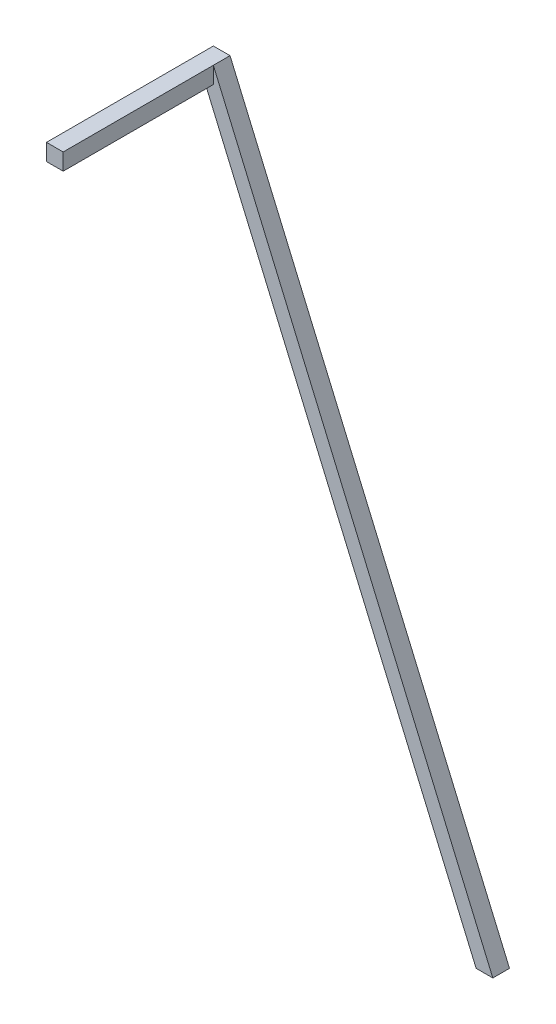
ISO-10303-21;
HEADER;
FILE_DESCRIPTION(('STEP AP214'),'2;1');
FILE_NAME('part.step','',(''),(''),'','','');
FILE_SCHEMA(('AUTOMOTIVE_DESIGN { 1 0 10303 214 1 1 1 1 }'));
ENDSEC;
DATA;
#1=APPLICATION_CONTEXT('core data for automotive mechanical design processes');
#2=APPLICATION_PROTOCOL_DEFINITION('international standard','automotive_design',2000,#1);
#3=PRODUCT_CONTEXT('',#1,'mechanical');
#4=PRODUCT('Part','Part','',(#3));
#5=PRODUCT_RELATED_PRODUCT_CATEGORY('part','',(#4));
#6=PRODUCT_DEFINITION_FORMATION('','',#4);
#7=PRODUCT_DEFINITION_CONTEXT('part definition',#1,'design');
#8=PRODUCT_DEFINITION('design','',#6,#7);
#9=PRODUCT_DEFINITION_SHAPE('','',#8);
#10=(LENGTH_UNIT() NAMED_UNIT(*) SI_UNIT(.MILLI.,.METRE.));
#11=(NAMED_UNIT(*) PLANE_ANGLE_UNIT() SI_UNIT($,.RADIAN.));
#12=(NAMED_UNIT(*) SI_UNIT($,.STERADIAN.) SOLID_ANGLE_UNIT());
#13=UNCERTAINTY_MEASURE_WITH_UNIT(LENGTH_MEASURE(1.E-05),#10,'distance_accuracy_value','');
#14=(GEOMETRIC_REPRESENTATION_CONTEXT(3) GLOBAL_UNCERTAINTY_ASSIGNED_CONTEXT((#13)) GLOBAL_UNIT_ASSIGNED_CONTEXT((#10,
#11,#12)) REPRESENTATION_CONTEXT('',''));
#15=CARTESIAN_POINT('',(0.,0.,0.));
#16=DIRECTION('',(0.,0.,1.));
#17=DIRECTION('',(1.,0.,0.));
#18=AXIS2_PLACEMENT_3D('',#15,#16,#17);
#19=CARTESIAN_POINT('',(12.7,12.7,25.4));
#20=DIRECTION('',(1.,0.,0.));
#21=DIRECTION('',(0.,0.,-1.));
#22=AXIS2_PLACEMENT_3D('',#19,#20,#21);
#23=PLANE('',#22);
#24=DIRECTION('',(0.,-1.,0.));
#25=VECTOR('',#24,1.);
#26=CARTESIAN_POINT('',(12.7,12.7,0.));
#27=LINE('',#26,#25);
#28=CARTESIAN_POINT('',(12.7,12.7,0.));
#29=VERTEX_POINT('',#28);
#30=CARTESIAN_POINT('',(12.7,-12.7,0.));
#31=VERTEX_POINT('',#30);
#32=EDGE_CURVE('E119',#29,#31,#27,.T.);
#33=ORIENTED_EDGE('',*,*,#32,.T.);
#34=DIRECTION('',(0.,0.,-1.));
#35=VECTOR('',#34,1.);
#36=CARTESIAN_POINT('',(12.7,-12.7,25.4));
#37=LINE('',#36,#35);
#38=CARTESIAN_POINT('',(12.7,-12.7,25.4));
#39=VERTEX_POINT('',#38);
#40=EDGE_CURVE('E12',#39,#31,#37,.T.);
#41=ORIENTED_EDGE('',*,*,#40,.F.);
#42=DIRECTION('',(0.,-1.,0.));
#43=VECTOR('',#42,1.);
#44=CARTESIAN_POINT('',(12.7,12.7,25.4));
#45=LINE('',#44,#43);
#46=CARTESIAN_POINT('',(12.7,12.7,25.4));
#47=VERTEX_POINT('',#46);
#48=EDGE_CURVE('E127',#47,#39,#45,.T.);
#49=ORIENTED_EDGE('',*,*,#48,.F.);
#50=DIRECTION('',(0.,0.,-1.));
#51=VECTOR('',#50,1.);
#52=CARTESIAN_POINT('',(12.7,12.7,25.4));
#53=LINE('',#52,#51);
#54=EDGE_CURVE('E115',#47,#29,#53,.T.);
#55=ORIENTED_EDGE('',*,*,#54,.T.);
#56=EDGE_LOOP('',(#33,#41,#49,#55));
#57=FACE_BOUND('',#56,.T.);
#58=ADVANCED_FACE('F45',(#57),#23,.F.);
#59=CARTESIAN_POINT('',(-1.79102564102583,-12.7,25.4));
#60=DIRECTION('',(0.,-1.,0.));
#61=DIRECTION('',(0.,0.,-1.));
#62=AXIS2_PLACEMENT_3D('',#59,#60,#61);
#63=PLANE('',#62);
#64=DIRECTION('',(-1.,0.,0.));
#65=VECTOR('',#64,1.);
#66=CARTESIAN_POINT('',(-1.79102564102583,-12.7,0.));
#67=LINE('',#66,#65);
#68=CARTESIAN_POINT('',(-1.79102564102583,-12.7,0.));
#69=VERTEX_POINT('',#68);
#70=EDGE_CURVE('E122',#31,#69,#67,.T.);
#71=ORIENTED_EDGE('',*,*,#70,.T.);
#72=DIRECTION('',(0.,0.,-1.));
#73=VECTOR('',#72,1.);
#74=CARTESIAN_POINT('',(-1.79102564102583,-12.7,25.4));
#75=LINE('',#74,#73);
#76=CARTESIAN_POINT('',(-1.79102564102583,-12.7,25.4));
#77=VERTEX_POINT('',#76);
#78=EDGE_CURVE('E53',#77,#69,#75,.T.);
#79=ORIENTED_EDGE('',*,*,#78,.F.);
#80=DIRECTION('',(-1.,0.,0.));
#81=VECTOR('',#80,1.);
#82=CARTESIAN_POINT('',(-1.79102564102583,-12.7,25.4));
#83=LINE('',#82,#81);
#84=EDGE_CURVE('E95',#39,#77,#83,.T.);
#85=ORIENTED_EDGE('',*,*,#84,.F.);
#86=ORIENTED_EDGE('',*,*,#40,.T.);
#87=EDGE_LOOP('',(#71,#79,#85,#86));
#88=FACE_BOUND('',#87,.T.);
#89=ADVANCED_FACE('F146',(#88),#63,.F.);
#90=CARTESIAN_POINT('',(412.75,-977.9,25.4));
#91=DIRECTION('',(0.918840099923866,0.39463004291602,0.));
#92=DIRECTION('',(-0.39463004291602,0.918840099923866,0.));
#93=AXIS2_PLACEMENT_3D('',#90,#91,#92);
#94=PLANE('',#93);
#95=DIRECTION('',(0.39463004291602,-0.918840099923866,0.));
#96=VECTOR('',#95,1.);
#97=CARTESIAN_POINT('',(412.75,-977.9,0.));
#98=LINE('',#97,#96);
#99=CARTESIAN_POINT('',(412.75,-977.9,0.));
#100=VERTEX_POINT('',#99);
#101=EDGE_CURVE('E110',#69,#100,#98,.T.);
#102=ORIENTED_EDGE('',*,*,#101,.T.);
#103=DIRECTION('',(0.,0.,-1.));
#104=VECTOR('',#103,1.);
#105=CARTESIAN_POINT('',(412.75,-977.9,25.4));
#106=LINE('',#105,#104);
#107=CARTESIAN_POINT('',(412.75,-977.9,25.4));
#108=VERTEX_POINT('',#107);
#109=EDGE_CURVE('E107',#108,#100,#106,.T.);
#110=ORIENTED_EDGE('',*,*,#109,.F.);
#111=DIRECTION('',(0.39463004291602,-0.918840099923866,0.));
#112=VECTOR('',#111,1.);
#113=CARTESIAN_POINT('',(412.75,-977.9,25.4));
#114=LINE('',#113,#112);
#115=EDGE_CURVE('E99',#77,#108,#114,.T.);
#116=ORIENTED_EDGE('',*,*,#115,.F.);
#117=ORIENTED_EDGE('',*,*,#78,.T.);
#118=EDGE_LOOP('',(#102,#110,#116,#117));
#119=FACE_BOUND('',#118,.T.);
#120=ADVANCED_FACE('F108',(#119),#94,.F.);
#121=CARTESIAN_POINT('',(412.75,-977.9,25.4));
#122=DIRECTION('',(0.,1.,0.));
#123=DIRECTION('',(0.,0.,1.));
#124=AXIS2_PLACEMENT_3D('',#121,#122,#123);
#125=PLANE('',#124);
#126=DIRECTION('',(1.,0.,0.));
#127=VECTOR('',#126,1.);
#128=CARTESIAN_POINT('',(412.75,-977.9,0.));
#129=LINE('',#128,#127);
#130=CARTESIAN_POINT('',(438.15,-977.9,0.));
#131=VERTEX_POINT('',#130);
#132=EDGE_CURVE('E81',#100,#131,#129,.T.);
#133=ORIENTED_EDGE('',*,*,#132,.T.);
#134=DIRECTION('',(0.,0.,-1.));
#135=VECTOR('',#134,1.);
#136=CARTESIAN_POINT('',(438.15,-977.9,25.4));
#137=LINE('',#136,#135);
#138=CARTESIAN_POINT('',(438.15,-977.9,25.4));
#139=VERTEX_POINT('',#138);
#140=EDGE_CURVE('E111',#139,#131,#137,.T.);
#141=ORIENTED_EDGE('',*,*,#140,.F.);
#142=DIRECTION('',(1.,0.,0.));
#143=VECTOR('',#142,1.);
#144=CARTESIAN_POINT('',(412.75,-977.9,25.4));
#145=LINE('',#144,#143);
#146=EDGE_CURVE('E103',#108,#139,#145,.T.);
#147=ORIENTED_EDGE('',*,*,#146,.F.);
#148=ORIENTED_EDGE('',*,*,#109,.T.);
#149=EDGE_LOOP('',(#133,#141,#147,#148));
#150=FACE_BOUND('',#149,.T.);
#151=ADVANCED_FACE('F113',(#150),#125,.F.);
#152=CARTESIAN_POINT('',(12.7,12.7,25.4));
#153=DIRECTION('',(-0.918840099923866,-0.394630042916019,0.));
#154=DIRECTION('',(0.394630042916019,-0.918840099923866,0.));
#155=AXIS2_PLACEMENT_3D('',#152,#153,#154);
#156=PLANE('',#155);
#157=DIRECTION('',(-0.39463004291602,0.918840099923866,0.));
#158=VECTOR('',#157,1.);
#159=CARTESIAN_POINT('',(12.7,12.7,0.));
#160=LINE('',#159,#158);
#161=EDGE_CURVE('E87',#131,#29,#160,.T.);
#162=ORIENTED_EDGE('',*,*,#161,.T.);
#163=ORIENTED_EDGE('',*,*,#54,.F.);
#164=DIRECTION('',(-0.39463004291602,0.918840099923866,0.));
#165=VECTOR('',#164,1.);
#166=CARTESIAN_POINT('',(12.7,12.7,25.4));
#167=LINE('',#166,#165);
#168=EDGE_CURVE('E61',#139,#47,#167,.T.);
#169=ORIENTED_EDGE('',*,*,#168,.F.);
#170=ORIENTED_EDGE('',*,*,#140,.T.);
#171=EDGE_LOOP('',(#162,#163,#169,#170));
#172=FACE_BOUND('',#171,.T.);
#173=ADVANCED_FACE('F135',(#172),#156,.F.);
#174=CARTESIAN_POINT('',(0.,0.,25.4));
#175=DIRECTION('',(0.,0.,1.));
#176=DIRECTION('',(1.,0.,0.));
#177=AXIS2_PLACEMENT_3D('',#174,#175,#176);
#178=PLANE('',#177);
#179=ORIENTED_EDGE('',*,*,#48,.T.);
#180=ORIENTED_EDGE('',*,*,#84,.T.);
#181=ORIENTED_EDGE('',*,*,#115,.T.);
#182=ORIENTED_EDGE('',*,*,#146,.T.);
#183=ORIENTED_EDGE('',*,*,#168,.T.);
#184=EDGE_LOOP('',(#179,#180,#181,#182,#183));
#185=FACE_BOUND('',#184,.T.);
#186=ADVANCED_FACE('F101',(#185),#178,.T.);
#187=CARTESIAN_POINT('',(0.,0.,0.));
#188=DIRECTION('',(0.,0.,1.));
#189=DIRECTION('',(1.,0.,0.));
#190=AXIS2_PLACEMENT_3D('',#187,#188,#189);
#191=PLANE('',#190);
#192=ORIENTED_EDGE('',*,*,#32,.F.);
#193=ORIENTED_EDGE('',*,*,#161,.F.);
#194=ORIENTED_EDGE('',*,*,#132,.F.);
#195=ORIENTED_EDGE('',*,*,#101,.F.);
#196=ORIENTED_EDGE('',*,*,#70,.F.);
#197=EDGE_LOOP('',(#192,#193,#194,#195,#196));
#198=FACE_BOUND('',#197,.T.);
#199=ADVANCED_FACE('F131',(#198),#191,.F.);
#200=CLOSED_SHELL('',(#58,#89,#120,#151,#173,#186,#199));
#201=MANIFOLD_SOLID_BREP('B2',#200);
#202=CARTESIAN_POINT('',(12.7,-12.7,254.));
#203=DIRECTION('',(-1.,0.,0.));
#204=DIRECTION('',(0.,0.,1.));
#205=AXIS2_PLACEMENT_3D('',#202,#203,#204);
#206=PLANE('',#205);
#207=DIRECTION('',(0.,1.,0.));
#208=VECTOR('',#207,1.);
#209=CARTESIAN_POINT('',(12.7,-12.7,0.));
#210=LINE('',#209,#208);
#211=CARTESIAN_POINT('',(12.7,-12.7,0.));
#212=VERTEX_POINT('',#211);
#213=CARTESIAN_POINT('',(12.7,12.7,0.));
#214=VERTEX_POINT('',#213);
#215=EDGE_CURVE('E258',#212,#214,#210,.T.);
#216=ORIENTED_EDGE('',*,*,#215,.T.);
#217=DIRECTION('',(0.,0.,-1.));
#218=VECTOR('',#217,1.);
#219=CARTESIAN_POINT('',(12.7,12.7,254.));
#220=LINE('',#219,#218);
#221=CARTESIAN_POINT('',(12.7,12.7,254.));
#222=VERTEX_POINT('',#221);
#223=EDGE_CURVE('E43',#222,#214,#220,.T.);
#224=ORIENTED_EDGE('',*,*,#223,.F.);
#225=DIRECTION('',(0.,1.,0.));
#226=VECTOR('',#225,1.);
#227=CARTESIAN_POINT('',(12.7,-12.7,254.));
#228=LINE('',#227,#226);
#229=CARTESIAN_POINT('',(12.7,-12.7,254.));
#230=VERTEX_POINT('',#229);
#231=EDGE_CURVE('E246',#230,#222,#228,.T.);
#232=ORIENTED_EDGE('',*,*,#231,.F.);
#233=DIRECTION('',(0.,0.,-1.));
#234=VECTOR('',#233,1.);
#235=CARTESIAN_POINT('',(12.7,-12.7,254.));
#236=LINE('',#235,#234);
#237=EDGE_CURVE('E254',#230,#212,#236,.T.);
#238=ORIENTED_EDGE('',*,*,#237,.T.);
#239=EDGE_LOOP('',(#216,#224,#232,#238));
#240=FACE_BOUND('',#239,.T.);
#241=ADVANCED_FACE('F195',(#240),#206,.F.);
#242=CARTESIAN_POINT('',(-12.7,12.7,254.));
#243=DIRECTION('',(0.,-1.,0.));
#244=DIRECTION('',(0.,0.,-1.));
#245=AXIS2_PLACEMENT_3D('',#242,#243,#244);
#246=PLANE('',#245);
#247=DIRECTION('',(-1.,0.,0.));
#248=VECTOR('',#247,1.);
#249=CARTESIAN_POINT('',(-12.7,12.7,0.));
#250=LINE('',#249,#248);
#251=CARTESIAN_POINT('',(-12.7,12.7,0.));
#252=VERTEX_POINT('',#251);
#253=EDGE_CURVE('E250',#214,#252,#250,.T.);
#254=ORIENTED_EDGE('',*,*,#253,.T.);
#255=DIRECTION('',(0.,0.,-1.));
#256=VECTOR('',#255,1.);
#257=CARTESIAN_POINT('',(-12.7,12.7,254.));
#258=LINE('',#257,#256);
#259=CARTESIAN_POINT('',(-12.7,12.7,254.));
#260=VERTEX_POINT('',#259);
#261=EDGE_CURVE('E203',#260,#252,#258,.T.);
#262=ORIENTED_EDGE('',*,*,#261,.F.);
#263=DIRECTION('',(-1.,0.,0.));
#264=VECTOR('',#263,1.);
#265=CARTESIAN_POINT('',(-12.7,12.7,254.));
#266=LINE('',#265,#264);
#267=EDGE_CURVE('E241',#222,#260,#266,.T.);
#268=ORIENTED_EDGE('',*,*,#267,.F.);
#269=ORIENTED_EDGE('',*,*,#223,.T.);
#270=EDGE_LOOP('',(#254,#262,#268,#269));
#271=FACE_BOUND('',#270,.T.);
#272=ADVANCED_FACE('F249',(#271),#246,.F.);
#273=CARTESIAN_POINT('',(-12.7,-12.7,254.));
#274=DIRECTION('',(1.,0.,0.));
#275=DIRECTION('',(0.,0.,-1.));
#276=AXIS2_PLACEMENT_3D('',#273,#274,#275);
#277=PLANE('',#276);
#278=DIRECTION('',(0.,-1.,0.));
#279=VECTOR('',#278,1.);
#280=CARTESIAN_POINT('',(-12.7,-12.7,0.));
#281=LINE('',#280,#279);
#282=CARTESIAN_POINT('',(-12.7,-12.7,0.));
#283=VERTEX_POINT('',#282);
#284=EDGE_CURVE('E228',#252,#283,#281,.T.);
#285=ORIENTED_EDGE('',*,*,#284,.T.);
#286=DIRECTION('',(0.,0.,-1.));
#287=VECTOR('',#286,1.);
#288=CARTESIAN_POINT('',(-12.7,-12.7,254.));
#289=LINE('',#288,#287);
#290=CARTESIAN_POINT('',(-12.7,-12.7,254.));
#291=VERTEX_POINT('',#290);
#292=EDGE_CURVE('E251',#291,#283,#289,.T.);
#293=ORIENTED_EDGE('',*,*,#292,.F.);
#294=DIRECTION('',(0.,-1.,0.));
#295=VECTOR('',#294,1.);
#296=CARTESIAN_POINT('',(-12.7,-12.7,254.));
#297=LINE('',#296,#295);
#298=EDGE_CURVE('E244',#260,#291,#297,.T.);
#299=ORIENTED_EDGE('',*,*,#298,.F.);
#300=ORIENTED_EDGE('',*,*,#261,.T.);
#301=EDGE_LOOP('',(#285,#293,#299,#300));
#302=FACE_BOUND('',#301,.T.);
#303=ADVANCED_FACE('F252',(#302),#277,.F.);
#304=CARTESIAN_POINT('',(-12.7,-12.7,254.));
#305=DIRECTION('',(0.,1.,0.));
#306=DIRECTION('',(0.,0.,1.));
#307=AXIS2_PLACEMENT_3D('',#304,#305,#306);
#308=PLANE('',#307);
#309=DIRECTION('',(1.,0.,0.));
#310=VECTOR('',#309,1.);
#311=CARTESIAN_POINT('',(-12.7,-12.7,0.));
#312=LINE('',#311,#310);
#313=EDGE_CURVE('E234',#283,#212,#312,.T.);
#314=ORIENTED_EDGE('',*,*,#313,.T.);
#315=ORIENTED_EDGE('',*,*,#237,.F.);
#316=DIRECTION('',(1.,0.,0.));
#317=VECTOR('',#316,1.);
#318=CARTESIAN_POINT('',(-12.7,-12.7,254.));
#319=LINE('',#318,#317);
#320=EDGE_CURVE('E211',#291,#230,#319,.T.);
#321=ORIENTED_EDGE('',*,*,#320,.F.);
#322=ORIENTED_EDGE('',*,*,#292,.T.);
#323=EDGE_LOOP('',(#314,#315,#321,#322));
#324=FACE_BOUND('',#323,.T.);
#325=ADVANCED_FACE('F265',(#324),#308,.F.);
#326=CARTESIAN_POINT('',(0.,0.,254.));
#327=DIRECTION('',(0.,0.,-1.));
#328=DIRECTION('',(-1.,0.,0.));
#329=AXIS2_PLACEMENT_3D('',#326,#327,#328);
#330=PLANE('',#329);
#331=ORIENTED_EDGE('',*,*,#231,.T.);
#332=ORIENTED_EDGE('',*,*,#267,.T.);
#333=ORIENTED_EDGE('',*,*,#298,.T.);
#334=ORIENTED_EDGE('',*,*,#320,.T.);
#335=EDGE_LOOP('',(#331,#332,#333,#334));
#336=FACE_BOUND('',#335,.T.);
#337=ADVANCED_FACE('F242',(#336),#330,.F.);
#338=CARTESIAN_POINT('',(0.,0.,0.));
#339=DIRECTION('',(0.,0.,-1.));
#340=DIRECTION('',(-1.,0.,0.));
#341=AXIS2_PLACEMENT_3D('',#338,#339,#340);
#342=PLANE('',#341);
#343=ORIENTED_EDGE('',*,*,#215,.F.);
#344=ORIENTED_EDGE('',*,*,#313,.F.);
#345=ORIENTED_EDGE('',*,*,#284,.F.);
#346=ORIENTED_EDGE('',*,*,#253,.F.);
#347=EDGE_LOOP('',(#343,#344,#345,#346));
#348=FACE_BOUND('',#347,.T.);
#349=ADVANCED_FACE('F268',(#348),#342,.T.);
#350=CLOSED_SHELL('',(#241,#272,#303,#325,#337,#349));
#351=MANIFOLD_SOLID_BREP('B6',#350);
#352=ADVANCED_BREP_SHAPE_REPRESENTATION('',(#18,#201,#351),#14);
#353=SHAPE_DEFINITION_REPRESENTATION(#9,#352);
ENDSEC;
END-ISO-10303-21;
